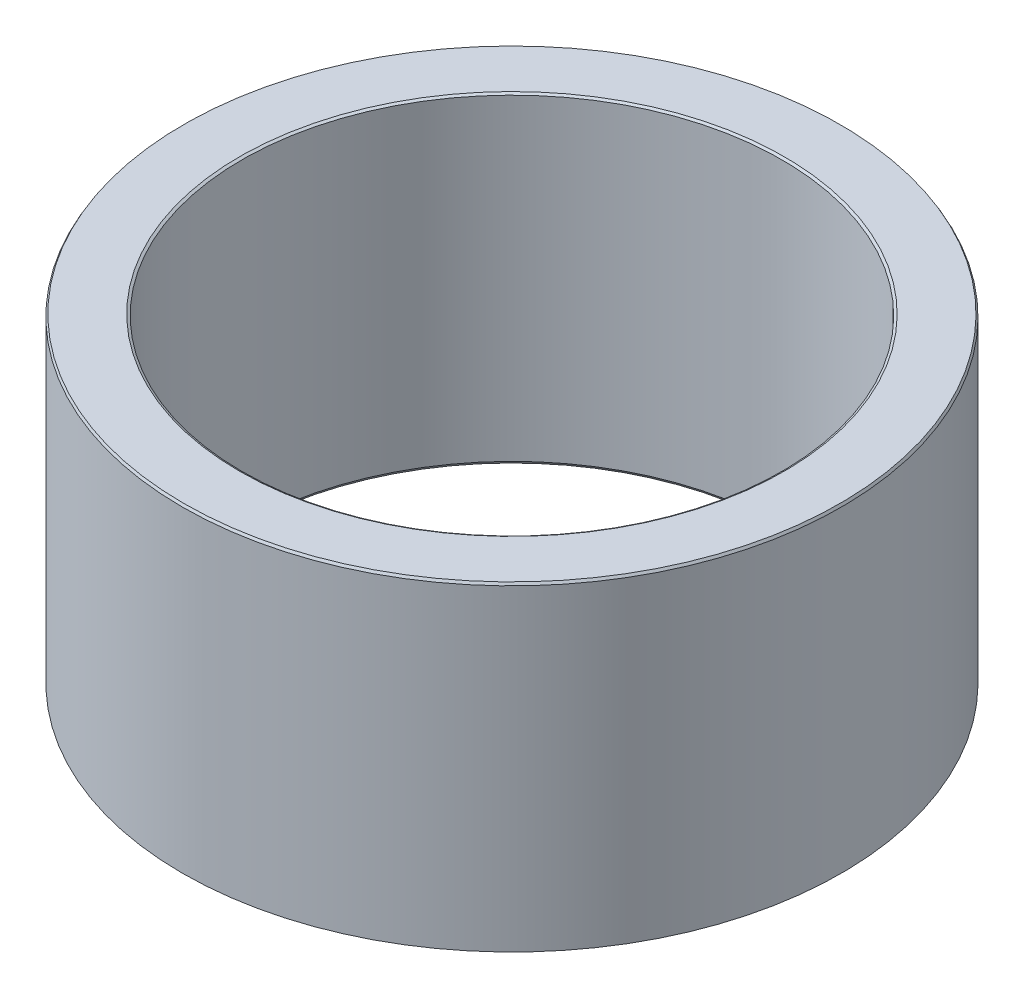
ISO-10303-21;
HEADER;
FILE_DESCRIPTION(('STEP AP214'),'2;1');
FILE_NAME('part.step','',(''),(''),'','','');
FILE_SCHEMA(('AUTOMOTIVE_DESIGN { 1 0 10303 214 1 1 1 1 }'));
ENDSEC;
DATA;
#1=APPLICATION_CONTEXT('core data for automotive mechanical design processes');
#2=APPLICATION_PROTOCOL_DEFINITION('international standard','automotive_design',2000,#1);
#3=PRODUCT_CONTEXT('',#1,'mechanical');
#4=PRODUCT('Part','Part','',(#3));
#5=PRODUCT_RELATED_PRODUCT_CATEGORY('part','',(#4));
#6=PRODUCT_DEFINITION_FORMATION('','',#4);
#7=PRODUCT_DEFINITION_CONTEXT('part definition',#1,'design');
#8=PRODUCT_DEFINITION('design','',#6,#7);
#9=PRODUCT_DEFINITION_SHAPE('','',#8);
#10=(LENGTH_UNIT() NAMED_UNIT(*) SI_UNIT(.MILLI.,.METRE.));
#11=(NAMED_UNIT(*) PLANE_ANGLE_UNIT() SI_UNIT($,.RADIAN.));
#12=(NAMED_UNIT(*) SI_UNIT($,.STERADIAN.) SOLID_ANGLE_UNIT());
#13=UNCERTAINTY_MEASURE_WITH_UNIT(LENGTH_MEASURE(1.E-05),#10,'distance_accuracy_value','');
#14=(GEOMETRIC_REPRESENTATION_CONTEXT(3) GLOBAL_UNCERTAINTY_ASSIGNED_CONTEXT((#13)) GLOBAL_UNIT_ASSIGNED_CONTEXT((#10,
#11,#12)) REPRESENTATION_CONTEXT('',''));
#15=CARTESIAN_POINT('',(0.,0.,0.));
#16=DIRECTION('',(0.,0.,1.));
#17=DIRECTION('',(1.,0.,0.));
#18=AXIS2_PLACEMENT_3D('',#15,#16,#17);
#19=CARTESIAN_POINT('',(0.,29.2172972839453,0.));
#20=DIRECTION('',(0.,-1.,0.));
#21=DIRECTION('',(0.,0.,-1.));
#22=AXIS2_PLACEMENT_3D('',#19,#20,#21);
#23=CYLINDRICAL_SURFACE('',#22,30.);
#24=CARTESIAN_POINT('',(0.,0.127689605257827,0.));
#25=DIRECTION('',(0.,1.,0.));
#26=DIRECTION('',(0.,0.,1.));
#27=AXIS2_PLACEMENT_3D('',#24,#25,#26);
#28=CIRCLE('',#27,30.);
#29=CARTESIAN_POINT('',(0.,0.127689605257827,30.));
#30=VERTEX_POINT('',#29);
#31=EDGE_CURVE('E10',#30,#30,#28,.T.);
#32=ORIENTED_EDGE('',*,*,#31,.T.);
#33=EDGE_LOOP('',(#32));
#34=FACE_BOUND('',#33,.T.);
#35=CARTESIAN_POINT('',(0.,28.9961324000403,0.));
#36=DIRECTION('',(0.,1.,0.));
#37=DIRECTION('',(0.,0.,1.));
#38=AXIS2_PLACEMENT_3D('',#35,#36,#37);
#39=CIRCLE('',#38,30.);
#40=CARTESIAN_POINT('',(0.,28.9961324000403,30.));
#41=VERTEX_POINT('',#40);
#42=EDGE_CURVE('E50',#41,#41,#39,.F.);
#43=ORIENTED_EDGE('',*,*,#42,.T.);
#44=EDGE_LOOP('',(#43));
#45=FACE_BOUND('',#44,.T.);
#46=ADVANCED_FACE('F39',(#34,#45),#23,.T.);
#47=CARTESIAN_POINT('',(0.,29.2172972839453,0.));
#48=DIRECTION('',(0.,1.,0.));
#49=DIRECTION('',(0.,0.,1.));
#50=AXIS2_PLACEMENT_3D('',#47,#48,#49);
#51=PLANE('',#50);
#52=CARTESIAN_POINT('',(0.,29.2172972839453,0.));
#53=DIRECTION('',(0.,1.,0.));
#54=DIRECTION('',(0.,0.,1.));
#55=AXIS2_PLACEMENT_3D('',#52,#53,#54);
#56=CIRCLE('',#55,24.7958353543186);
#57=CARTESIAN_POINT('',(0.,29.2172972839453,24.7958353543186));
#58=VERTEX_POINT('',#57);
#59=EDGE_CURVE('E58',#58,#58,#56,.F.);
#60=ORIENTED_EDGE('',*,*,#59,.T.);
#61=EDGE_LOOP('',(#60));
#62=FACE_BOUND('',#61,.T.);
#63=CARTESIAN_POINT('',(0.,29.2172972839453,0.));
#64=DIRECTION('',(0.,1.,0.));
#65=DIRECTION('',(0.,0.,1.));
#66=AXIS2_PLACEMENT_3D('',#63,#64,#65);
#67=CIRCLE('',#66,29.8723103947422);
#68=CARTESIAN_POINT('',(0.,29.2172972839453,29.8723103947422));
#69=VERTEX_POINT('',#68);
#70=EDGE_CURVE('E61',#69,#69,#67,.T.);
#71=ORIENTED_EDGE('',*,*,#70,.T.);
#72=EDGE_LOOP('',(#71));
#73=FACE_BOUND('',#72,.T.);
#74=ADVANCED_FACE('F88',(#62,#73),#51,.T.);
#75=CARTESIAN_POINT('',(0.,0.,0.));
#76=DIRECTION('',(0.,1.,0.));
#77=DIRECTION('',(0.,0.,1.));
#78=AXIS2_PLACEMENT_3D('',#75,#76,#77);
#79=PLANE('',#78);
#80=CARTESIAN_POINT('',(0.,0.,0.));
#81=DIRECTION('',(0.,1.,0.));
#82=DIRECTION('',(0.,0.,1.));
#83=AXIS2_PLACEMENT_3D('',#80,#81,#82);
#84=CIRCLE('',#83,24.7023600756714);
#85=CARTESIAN_POINT('',(0.,0.,24.7023600756714));
#86=VERTEX_POINT('',#85);
#87=EDGE_CURVE('E51',#86,#86,#84,.T.);
#88=ORIENTED_EDGE('',*,*,#87,.T.);
#89=EDGE_LOOP('',(#88));
#90=FACE_BOUND('',#89,.T.);
#91=CARTESIAN_POINT('',(0.,0.,0.));
#92=DIRECTION('',(0.,1.,0.));
#93=DIRECTION('',(0.,0.,1.));
#94=AXIS2_PLACEMENT_3D('',#91,#92,#93);
#95=CIRCLE('',#94,29.778835116095);
#96=CARTESIAN_POINT('',(0.,0.,29.778835116095));
#97=VERTEX_POINT('',#96);
#98=EDGE_CURVE('E54',#97,#97,#95,.F.);
#99=ORIENTED_EDGE('',*,*,#98,.T.);
#100=EDGE_LOOP('',(#99));
#101=FACE_BOUND('',#100,.T.);
#102=ADVANCED_FACE('F83',(#90,#101),#79,.F.);
#103=CARTESIAN_POINT('',(0.,29.2172972839453,0.));
#104=DIRECTION('',(0.,-1.,0.));
#105=DIRECTION('',(0.,0.,-1.));
#106=AXIS2_PLACEMENT_3D('',#103,#104,#105);
#107=CYLINDRICAL_SURFACE('',#106,24.5746704704136);
#108=CARTESIAN_POINT('',(0.,29.0896076786875,0.));
#109=DIRECTION('',(0.,1.,0.));
#110=DIRECTION('',(0.,0.,1.));
#111=AXIS2_PLACEMENT_3D('',#108,#109,#110);
#112=CIRCLE('',#111,24.5746704704136);
#113=CARTESIAN_POINT('',(0.,29.0896076786875,24.5746704704136));
#114=VERTEX_POINT('',#113);
#115=EDGE_CURVE('E67',#114,#114,#112,.T.);
#116=ORIENTED_EDGE('',*,*,#115,.T.);
#117=EDGE_LOOP('',(#116));
#118=FACE_BOUND('',#117,.T.);
#119=CARTESIAN_POINT('',(0.,0.221164883904987,0.));
#120=DIRECTION('',(0.,1.,0.));
#121=DIRECTION('',(0.,0.,1.));
#122=AXIS2_PLACEMENT_3D('',#119,#120,#121);
#123=CIRCLE('',#122,24.5746704704136);
#124=CARTESIAN_POINT('',(0.,0.221164883904987,24.5746704704136));
#125=VERTEX_POINT('',#124);
#126=EDGE_CURVE('E69',#125,#125,#123,.F.);
#127=ORIENTED_EDGE('',*,*,#126,.T.);
#128=EDGE_LOOP('',(#127));
#129=FACE_BOUND('',#128,.T.);
#130=ADVANCED_FACE('F71',(#118,#129),#107,.F.);
#131=CARTESIAN_POINT('',(0.,29.0896076786875,0.));
#132=DIRECTION('',(0.,1.,0.));
#133=DIRECTION('',(0.,0.,1.));
#134=AXIS2_PLACEMENT_3D('',#131,#132,#133);
#135=CONICAL_SURFACE('',#134,24.5746704704136,1.04719755119658);
#136=ORIENTED_EDGE('',*,*,#59,.F.);
#137=EDGE_LOOP('',(#136));
#138=FACE_BOUND('',#137,.T.);
#139=ORIENTED_EDGE('',*,*,#115,.F.);
#140=EDGE_LOOP('',(#139));
#141=FACE_BOUND('',#140,.T.);
#142=ADVANCED_FACE('F77',(#138,#141),#135,.F.);
#143=CARTESIAN_POINT('',(0.,0.,0.));
#144=DIRECTION('',(0.,-1.,0.));
#145=DIRECTION('',(0.,0.,-1.));
#146=AXIS2_PLACEMENT_3D('',#143,#144,#145);
#147=CONICAL_SURFACE('',#146,24.7023600756714,0.523598775598301);
#148=ORIENTED_EDGE('',*,*,#126,.F.);
#149=EDGE_LOOP('',(#148));
#150=FACE_BOUND('',#149,.T.);
#151=ORIENTED_EDGE('',*,*,#87,.F.);
#152=EDGE_LOOP('',(#151));
#153=FACE_BOUND('',#152,.T.);
#154=ADVANCED_FACE('F73',(#150,#153),#147,.F.);
#155=CARTESIAN_POINT('',(0.,0.127689605257827,0.));
#156=DIRECTION('',(0.,1.,0.));
#157=DIRECTION('',(0.,0.,1.));
#158=AXIS2_PLACEMENT_3D('',#155,#156,#157);
#159=CONICAL_SURFACE('',#158,30.,1.04719755119662);
#160=ORIENTED_EDGE('',*,*,#98,.F.);
#161=EDGE_LOOP('',(#160));
#162=FACE_BOUND('',#161,.T.);
#163=ORIENTED_EDGE('',*,*,#31,.F.);
#164=EDGE_LOOP('',(#163));
#165=FACE_BOUND('',#164,.T.);
#166=ADVANCED_FACE('F76',(#162,#165),#159,.T.);
#167=CARTESIAN_POINT('',(0.,29.2172972839453,0.));
#168=DIRECTION('',(0.,-1.,0.));
#169=DIRECTION('',(0.,0.,-1.));
#170=AXIS2_PLACEMENT_3D('',#167,#168,#169);
#171=CONICAL_SURFACE('',#170,29.8723103947422,0.523598775598271);
#172=ORIENTED_EDGE('',*,*,#42,.F.);
#173=EDGE_LOOP('',(#172));
#174=FACE_BOUND('',#173,.T.);
#175=ORIENTED_EDGE('',*,*,#70,.F.);
#176=EDGE_LOOP('',(#175));
#177=FACE_BOUND('',#176,.T.);
#178=ADVANCED_FACE('F45',(#174,#177),#171,.T.);
#179=CLOSED_SHELL('',(#46,#74,#102,#130,#142,#154,#166,#178));
#180=MANIFOLD_SOLID_BREP('B2',#179);
#181=ADVANCED_BREP_SHAPE_REPRESENTATION('',(#18,#180),#14);
#182=SHAPE_DEFINITION_REPRESENTATION(#9,#181);
ENDSEC;
END-ISO-10303-21;
